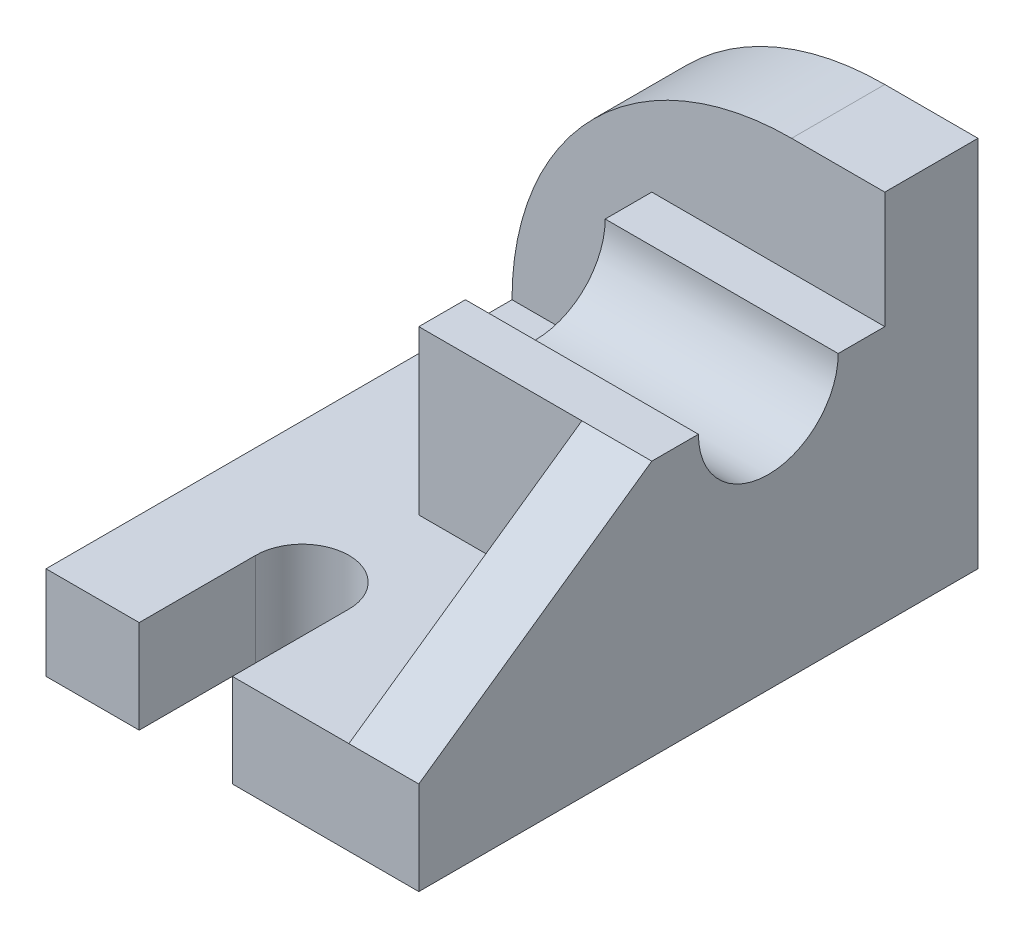
ISO-10303-21;
HEADER;
FILE_DESCRIPTION(('STEP AP214'),'2;1');
FILE_NAME('part.step','',(''),(''),'','','');
FILE_SCHEMA(('AUTOMOTIVE_DESIGN { 1 0 10303 214 1 1 1 1 }'));
ENDSEC;
DATA;
#1=APPLICATION_CONTEXT('core data for automotive mechanical design processes');
#2=APPLICATION_PROTOCOL_DEFINITION('international standard','automotive_design',2000,#1);
#3=PRODUCT_CONTEXT('',#1,'mechanical');
#4=PRODUCT('Part','Part','',(#3));
#5=PRODUCT_RELATED_PRODUCT_CATEGORY('part','',(#4));
#6=PRODUCT_DEFINITION_FORMATION('','',#4);
#7=PRODUCT_DEFINITION_CONTEXT('part definition',#1,'design');
#8=PRODUCT_DEFINITION('design','',#6,#7);
#9=PRODUCT_DEFINITION_SHAPE('','',#8);
#10=(LENGTH_UNIT() NAMED_UNIT(*) SI_UNIT(.MILLI.,.METRE.));
#11=(NAMED_UNIT(*) PLANE_ANGLE_UNIT() SI_UNIT($,.RADIAN.));
#12=(NAMED_UNIT(*) SI_UNIT($,.STERADIAN.) SOLID_ANGLE_UNIT());
#13=UNCERTAINTY_MEASURE_WITH_UNIT(LENGTH_MEASURE(1.E-05),#10,'distance_accuracy_value','');
#14=(GEOMETRIC_REPRESENTATION_CONTEXT(3) GLOBAL_UNCERTAINTY_ASSIGNED_CONTEXT((#13)) GLOBAL_UNIT_ASSIGNED_CONTEXT((#10,
#11,#12)) REPRESENTATION_CONTEXT('',''));
#15=CARTESIAN_POINT('',(0.,0.,0.));
#16=DIRECTION('',(0.,0.,1.));
#17=DIRECTION('',(1.,0.,0.));
#18=AXIS2_PLACEMENT_3D('',#15,#16,#17);
#19=CARTESIAN_POINT('',(-32.,16.,48.));
#20=DIRECTION('',(0.,0.,-1.));
#21=DIRECTION('',(-1.,0.,0.));
#22=AXIS2_PLACEMENT_3D('',#19,#20,#21);
#23=PLANE('',#22);
#24=DIRECTION('',(0.,1.,0.));
#25=VECTOR('',#24,1.);
#26=CARTESIAN_POINT('',(-16.,0.,48.));
#27=LINE('',#26,#25);
#28=CARTESIAN_POINT('',(-16.,0.,48.));
#29=VERTEX_POINT('',#28);
#30=CARTESIAN_POINT('',(-16.,16.,48.));
#31=VERTEX_POINT('',#30);
#32=EDGE_CURVE('E182',#29,#31,#27,.T.);
#33=ORIENTED_EDGE('',*,*,#32,.T.);
#34=DIRECTION('',(1.,0.,0.));
#35=VECTOR('',#34,1.);
#36=CARTESIAN_POINT('',(-32.,16.,48.));
#37=LINE('',#36,#35);
#38=CARTESIAN_POINT('',(-32.,16.,48.));
#39=VERTEX_POINT('',#38);
#40=EDGE_CURVE('E241',#39,#31,#37,.T.);
#41=ORIENTED_EDGE('',*,*,#40,.F.);
#42=DIRECTION('',(0.,-1.,0.));
#43=VECTOR('',#42,1.);
#44=CARTESIAN_POINT('',(-32.,16.,48.));
#45=LINE('',#44,#43);
#46=CARTESIAN_POINT('',(-32.,0.,48.));
#47=VERTEX_POINT('',#46);
#48=EDGE_CURVE('E247',#39,#47,#45,.T.);
#49=ORIENTED_EDGE('',*,*,#48,.T.);
#50=DIRECTION('',(1.,0.,0.));
#51=VECTOR('',#50,1.);
#52=CARTESIAN_POINT('',(-32.,0.,48.));
#53=LINE('',#52,#51);
#54=EDGE_CURVE('E248',#47,#29,#53,.T.);
#55=ORIENTED_EDGE('',*,*,#54,.T.);
#56=EDGE_LOOP('',(#33,#41,#49,#55));
#57=FACE_BOUND('',#56,.T.);
#58=ADVANCED_FACE('F33',(#57),#23,.F.);
#59=CARTESIAN_POINT('',(0.,16.,0.));
#60=DIRECTION('',(0.,-1.,0.));
#61=DIRECTION('',(0.,0.,-1.));
#62=AXIS2_PLACEMENT_3D('',#59,#60,#61);
#63=PLANE('',#62);
#64=CARTESIAN_POINT('',(-8.00000000000002,16.,28.));
#65=DIRECTION('',(0.,1.,0.));
#66=DIRECTION('',(0.,0.,1.));
#67=AXIS2_PLACEMENT_3D('',#64,#65,#66);
#68=CIRCLE('',#67,8.);
#69=CARTESIAN_POINT('',(0.,16.,28.));
#70=VERTEX_POINT('',#69);
#71=CARTESIAN_POINT('',(-16.,16.,28.));
#72=VERTEX_POINT('',#71);
#73=EDGE_CURVE('E173',#70,#72,#68,.T.);
#74=ORIENTED_EDGE('',*,*,#73,.F.);
#75=DIRECTION('',(0.,0.,-1.));
#76=VECTOR('',#75,1.);
#77=CARTESIAN_POINT('',(0.,16.,48.));
#78=LINE('',#77,#76);
#79=CARTESIAN_POINT('',(0.,16.,48.));
#80=VERTEX_POINT('',#79);
#81=EDGE_CURVE('E156',#80,#70,#78,.T.);
#82=ORIENTED_EDGE('',*,*,#81,.F.);
#83=CARTESIAN_POINT('',(19.997847299372,16.,48.));
#84=VERTEX_POINT('',#83);
#85=EDGE_CURVE('E245',#80,#84,#37,.T.);
#86=ORIENTED_EDGE('',*,*,#85,.T.);
#87=DIRECTION('',(0.,0.,1.));
#88=VECTOR('',#87,1.);
#89=CARTESIAN_POINT('',(19.997847299372,16.,8.));
#90=LINE('',#89,#88);
#91=CARTESIAN_POINT('',(19.997847299372,16.,8.));
#92=VERTEX_POINT('',#91);
#93=EDGE_CURVE('E195',#92,#84,#90,.T.);
#94=ORIENTED_EDGE('',*,*,#93,.F.);
#95=DIRECTION('',(1.,0.,0.));
#96=VECTOR('',#95,1.);
#97=CARTESIAN_POINT('',(32.,16.,8.));
#98=LINE('',#97,#96);
#99=CARTESIAN_POINT('',(-8.00000000000001,16.,8.));
#100=VERTEX_POINT('',#99);
#101=EDGE_CURVE('E220',#100,#92,#98,.T.);
#102=ORIENTED_EDGE('',*,*,#101,.F.);
#103=DIRECTION('',(0.,0.,1.));
#104=VECTOR('',#103,1.);
#105=CARTESIAN_POINT('',(-8.00000000000001,16.,-32.));
#106=LINE('',#105,#104);
#107=CARTESIAN_POINT('',(-8.00000000000001,16.,-32.));
#108=VERTEX_POINT('',#107);
#109=EDGE_CURVE('E203',#108,#100,#106,.T.);
#110=ORIENTED_EDGE('',*,*,#109,.F.);
#111=DIRECTION('',(1.,0.,0.));
#112=VECTOR('',#111,1.);
#113=CARTESIAN_POINT('',(-32.,16.,-32.));
#114=LINE('',#113,#112);
#115=CARTESIAN_POINT('',(-32.,16.,-32.));
#116=VERTEX_POINT('',#115);
#117=EDGE_CURVE('E228',#116,#108,#114,.T.);
#118=ORIENTED_EDGE('',*,*,#117,.F.);
#119=DIRECTION('',(0.,0.,1.));
#120=VECTOR('',#119,1.);
#121=CARTESIAN_POINT('',(-32.,16.,-48.));
#122=LINE('',#121,#120);
#123=EDGE_CURVE('E244',#116,#39,#122,.T.);
#124=ORIENTED_EDGE('',*,*,#123,.T.);
#125=ORIENTED_EDGE('',*,*,#40,.T.);
#126=DIRECTION('',(0.,0.,-1.));
#127=VECTOR('',#126,1.);
#128=CARTESIAN_POINT('',(-16.,16.,48.));
#129=LINE('',#128,#127);
#130=EDGE_CURVE('E170',#31,#72,#129,.T.);
#131=ORIENTED_EDGE('',*,*,#130,.T.);
#132=EDGE_LOOP('',(#74,#82,#86,#94,#102,#110,#118,#124,#125,#131));
#133=FACE_BOUND('',#132,.T.);
#134=ADVANCED_FACE('F306',(#133),#63,.F.);
#135=CARTESIAN_POINT('',(32.,44.,8.));
#136=DIRECTION('',(0.,0.,-1.));
#137=DIRECTION('',(-1.,0.,0.));
#138=AXIS2_PLACEMENT_3D('',#135,#136,#137);
#139=PLANE('',#138);
#140=DIRECTION('',(0.,-1.,0.));
#141=VECTOR('',#140,1.);
#142=CARTESIAN_POINT('',(19.997847299372,44.,8.));
#143=LINE('',#142,#141);
#144=CARTESIAN_POINT('',(19.997847299372,44.,8.));
#145=VERTEX_POINT('',#144);
#146=EDGE_CURVE('E198',#145,#92,#143,.T.);
#147=ORIENTED_EDGE('',*,*,#146,.F.);
#148=DIRECTION('',(1.,0.,0.));
#149=VECTOR('',#148,1.);
#150=CARTESIAN_POINT('',(32.,44.,8.));
#151=LINE('',#150,#149);
#152=CARTESIAN_POINT('',(-8.00000000000001,44.,8.));
#153=VERTEX_POINT('',#152);
#154=EDGE_CURVE('E214',#153,#145,#151,.T.);
#155=ORIENTED_EDGE('',*,*,#154,.F.);
#156=DIRECTION('',(0.,-1.,0.));
#157=VECTOR('',#156,1.);
#158=CARTESIAN_POINT('',(-8.00000000000001,44.,8.));
#159=LINE('',#158,#157);
#160=EDGE_CURVE('E217',#153,#100,#159,.T.);
#161=ORIENTED_EDGE('',*,*,#160,.T.);
#162=ORIENTED_EDGE('',*,*,#101,.T.);
#163=EDGE_LOOP('',(#147,#155,#161,#162));
#164=FACE_BOUND('',#163,.T.);
#165=ADVANCED_FACE('F342',(#164),#139,.F.);
#166=CARTESIAN_POINT('',(0.,44.,0.));
#167=DIRECTION('',(0.,-1.,0.));
#168=DIRECTION('',(0.,0.,-1.));
#169=AXIS2_PLACEMENT_3D('',#166,#167,#168);
#170=PLANE('',#169);
#171=ORIENTED_EDGE('',*,*,#154,.T.);
#172=DIRECTION('',(-1.,0.,0.));
#173=VECTOR('',#172,1.);
#174=CARTESIAN_POINT('',(49.997847299372,44.,8.));
#175=LINE('',#174,#173);
#176=CARTESIAN_POINT('',(32.,44.,8.));
#177=VERTEX_POINT('',#176);
#178=EDGE_CURVE('E188',#177,#145,#175,.T.);
#179=ORIENTED_EDGE('',*,*,#178,.F.);
#180=DIRECTION('',(0.,0.,-1.));
#181=VECTOR('',#180,1.);
#182=CARTESIAN_POINT('',(32.,44.,-32.));
#183=LINE('',#182,#181);
#184=CARTESIAN_POINT('',(32.,44.,0.));
#185=VERTEX_POINT('',#184);
#186=EDGE_CURVE('E204',#177,#185,#183,.T.);
#187=ORIENTED_EDGE('',*,*,#186,.T.);
#188=DIRECTION('',(-1.,0.,0.));
#189=VECTOR('',#188,1.);
#190=CARTESIAN_POINT('',(55.,44.,0.));
#191=LINE('',#190,#189);
#192=CARTESIAN_POINT('',(-8.00000000000001,44.,0.));
#193=VERTEX_POINT('',#192);
#194=EDGE_CURVE('E11',#185,#193,#191,.T.);
#195=ORIENTED_EDGE('',*,*,#194,.T.);
#196=DIRECTION('',(0.,0.,1.));
#197=VECTOR('',#196,1.);
#198=CARTESIAN_POINT('',(-8.00000000000001,44.,-32.));
#199=LINE('',#198,#197);
#200=EDGE_CURVE('E210',#193,#153,#199,.T.);
#201=ORIENTED_EDGE('',*,*,#200,.T.);
#202=EDGE_LOOP('',(#171,#179,#187,#195,#201));
#203=FACE_BOUND('',#202,.T.);
#204=ADVANCED_FACE('F297',(#203),#170,.F.);
#205=CARTESIAN_POINT('',(-32.,64.,-32.));
#206=DIRECTION('',(0.,0.,-1.));
#207=DIRECTION('',(-1.,0.,0.));
#208=AXIS2_PLACEMENT_3D('',#205,#206,#207);
#209=PLANE('',#208);
#210=DIRECTION('',(0.,-1.,0.));
#211=VECTOR('',#210,1.);
#212=CARTESIAN_POINT('',(-8.00000000000001,44.,-32.));
#213=LINE('',#212,#211);
#214=CARTESIAN_POINT('',(-8.00000000000001,44.,-32.));
#215=VERTEX_POINT('',#214);
#216=EDGE_CURVE('E225',#215,#108,#213,.T.);
#217=ORIENTED_EDGE('',*,*,#216,.F.);
#218=DIRECTION('',(-1.,0.,0.));
#219=VECTOR('',#218,1.);
#220=CARTESIAN_POINT('',(32.,44.,-32.));
#221=LINE('',#220,#219);
#222=CARTESIAN_POINT('',(32.,44.,-32.));
#223=VERTEX_POINT('',#222);
#224=EDGE_CURVE('E206',#223,#215,#221,.T.);
#225=ORIENTED_EDGE('',*,*,#224,.F.);
#226=DIRECTION('',(0.,-1.,0.));
#227=VECTOR('',#226,1.);
#228=CARTESIAN_POINT('',(32.,64.,-32.));
#229=LINE('',#228,#227);
#230=CARTESIAN_POINT('',(32.,64.,-32.));
#231=VERTEX_POINT('',#230);
#232=EDGE_CURVE('E236',#231,#223,#229,.T.);
#233=ORIENTED_EDGE('',*,*,#232,.F.);
#234=DIRECTION('',(1.,0.,0.));
#235=VECTOR('',#234,1.);
#236=CARTESIAN_POINT('',(-32.,64.,-32.));
#237=LINE('',#236,#235);
#238=CARTESIAN_POINT('',(16.,64.,-32.));
#239=VERTEX_POINT('',#238);
#240=EDGE_CURVE('E229',#239,#231,#237,.T.);
#241=ORIENTED_EDGE('',*,*,#240,.F.);
#242=CARTESIAN_POINT('',(16.,16.,-32.));
#243=DIRECTION('',(0.,0.,-1.));
#244=DIRECTION('',(-1.,0.,0.));
#245=AXIS2_PLACEMENT_3D('',#242,#243,#244);
#246=CIRCLE('',#245,48.);
#247=EDGE_CURVE('E270',#239,#116,#246,.F.);
#248=ORIENTED_EDGE('',*,*,#247,.T.);
#249=ORIENTED_EDGE('',*,*,#117,.T.);
#250=EDGE_LOOP('',(#217,#225,#233,#241,#248,#249));
#251=FACE_BOUND('',#250,.T.);
#252=ADVANCED_FACE('F290',(#251),#209,.F.);
#253=ORIENTED_EDGE('',*,*,#85,.F.);
#254=DIRECTION('',(0.,1.,0.));
#255=VECTOR('',#254,1.);
#256=CARTESIAN_POINT('',(0.,0.,48.));
#257=LINE('',#256,#255);
#258=CARTESIAN_POINT('',(0.,0.,48.));
#259=VERTEX_POINT('',#258);
#260=EDGE_CURVE('E179',#259,#80,#257,.T.);
#261=ORIENTED_EDGE('',*,*,#260,.F.);
#262=CARTESIAN_POINT('',(32.,0.,48.));
#263=VERTEX_POINT('',#262);
#264=EDGE_CURVE('E169',#259,#263,#53,.T.);
#265=ORIENTED_EDGE('',*,*,#264,.T.);
#266=DIRECTION('',(0.,-1.,0.));
#267=VECTOR('',#266,1.);
#268=CARTESIAN_POINT('',(32.,16.,48.));
#269=LINE('',#268,#267);
#270=CARTESIAN_POINT('',(32.,16.,48.));
#271=VERTEX_POINT('',#270);
#272=EDGE_CURVE('E264',#271,#263,#269,.T.);
#273=ORIENTED_EDGE('',*,*,#272,.F.);
#274=DIRECTION('',(-1.,0.,0.));
#275=VECTOR('',#274,1.);
#276=CARTESIAN_POINT('',(49.997847299372,16.,48.));
#277=LINE('',#276,#275);
#278=EDGE_CURVE('E189',#271,#84,#277,.T.);
#279=ORIENTED_EDGE('',*,*,#278,.T.);
#280=EDGE_LOOP('',(#253,#261,#265,#273,#279));
#281=FACE_BOUND('',#280,.T.);
#282=ADVANCED_FACE('F304',(#281),#23,.F.);
#283=CARTESIAN_POINT('',(32.,16.,-48.));
#284=DIRECTION('',(1.,0.,0.));
#285=DIRECTION('',(0.,0.,-1.));
#286=AXIS2_PLACEMENT_3D('',#283,#284,#285);
#287=PLANE('',#286);
#288=DIRECTION('',(0.,0.573462344363328,-0.819231920519041));
#289=VECTOR('',#288,1.);
#290=CARTESIAN_POINT('',(32.,61.1006711409396,-16.4295302013423));
#291=LINE('',#290,#289);
#292=EDGE_CURVE('E192',#271,#177,#291,.T.);
#293=ORIENTED_EDGE('',*,*,#292,.F.);
#294=ORIENTED_EDGE('',*,*,#272,.T.);
#295=DIRECTION('',(0.,0.,1.));
#296=VECTOR('',#295,1.);
#297=CARTESIAN_POINT('',(32.,0.,-48.));
#298=LINE('',#297,#296);
#299=CARTESIAN_POINT('',(32.,0.,-48.));
#300=VERTEX_POINT('',#299);
#301=EDGE_CURVE('E251',#300,#263,#298,.T.);
#302=ORIENTED_EDGE('',*,*,#301,.F.);
#303=DIRECTION('',(0.,-1.,0.));
#304=VECTOR('',#303,1.);
#305=CARTESIAN_POINT('',(32.,16.,-48.));
#306=LINE('',#305,#304);
#307=CARTESIAN_POINT('',(32.,64.,-48.));
#308=VERTEX_POINT('',#307);
#309=EDGE_CURVE('E262',#308,#300,#306,.T.);
#310=ORIENTED_EDGE('',*,*,#309,.F.);
#311=DIRECTION('',(0.,0.,1.));
#312=VECTOR('',#311,1.);
#313=CARTESIAN_POINT('',(32.,64.,-48.));
#314=LINE('',#313,#312);
#315=EDGE_CURVE('E231',#308,#231,#314,.T.);
#316=ORIENTED_EDGE('',*,*,#315,.T.);
#317=ORIENTED_EDGE('',*,*,#232,.T.);
#318=CARTESIAN_POINT('',(32.,44.,-24.));
#319=VERTEX_POINT('',#318);
#320=EDGE_CURVE('E207',#319,#223,#183,.T.);
#321=ORIENTED_EDGE('',*,*,#320,.F.);
#322=CARTESIAN_POINT('',(32.,44.,-12.));
#323=DIRECTION('',(1.,0.,0.));
#324=DIRECTION('',(0.,0.,-1.));
#325=AXIS2_PLACEMENT_3D('',#322,#323,#324);
#326=CIRCLE('',#325,12.);
#327=EDGE_CURVE('E56',#185,#319,#326,.T.);
#328=ORIENTED_EDGE('',*,*,#327,.F.);
#329=ORIENTED_EDGE('',*,*,#186,.F.);
#330=EDGE_LOOP('',(#293,#294,#302,#310,#316,#317,#321,#328,#329));
#331=FACE_BOUND('',#330,.T.);
#332=ADVANCED_FACE('F283',(#331),#287,.T.);
#333=CARTESIAN_POINT('',(-32.,16.,-48.));
#334=DIRECTION('',(0.,0.,-1.));
#335=DIRECTION('',(-1.,0.,0.));
#336=AXIS2_PLACEMENT_3D('',#333,#334,#335);
#337=PLANE('',#336);
#338=DIRECTION('',(0.,-1.,0.));
#339=VECTOR('',#338,1.);
#340=CARTESIAN_POINT('',(-32.,16.,-48.));
#341=LINE('',#340,#339);
#342=CARTESIAN_POINT('',(-32.,16.,-48.));
#343=VERTEX_POINT('',#342);
#344=CARTESIAN_POINT('',(-32.,0.,-48.));
#345=VERTEX_POINT('',#344);
#346=EDGE_CURVE('E260',#343,#345,#341,.T.);
#347=ORIENTED_EDGE('',*,*,#346,.F.);
#348=CARTESIAN_POINT('',(16.,16.,-48.));
#349=DIRECTION('',(0.,0.,-1.));
#350=DIRECTION('',(-1.,0.,0.));
#351=AXIS2_PLACEMENT_3D('',#348,#349,#350);
#352=CIRCLE('',#351,48.);
#353=CARTESIAN_POINT('',(16.,64.,-48.));
#354=VERTEX_POINT('',#353);
#355=EDGE_CURVE('E274',#343,#354,#352,.T.);
#356=ORIENTED_EDGE('',*,*,#355,.T.);
#357=DIRECTION('',(1.,0.,0.));
#358=VECTOR('',#357,1.);
#359=CARTESIAN_POINT('',(-32.,64.,-48.));
#360=LINE('',#359,#358);
#361=EDGE_CURVE('E234',#354,#308,#360,.T.);
#362=ORIENTED_EDGE('',*,*,#361,.T.);
#363=ORIENTED_EDGE('',*,*,#309,.T.);
#364=DIRECTION('',(1.,0.,0.));
#365=VECTOR('',#364,1.);
#366=CARTESIAN_POINT('',(-32.,0.,-48.));
#367=LINE('',#366,#365);
#368=EDGE_CURVE('E253',#345,#300,#367,.T.);
#369=ORIENTED_EDGE('',*,*,#368,.F.);
#370=EDGE_LOOP('',(#347,#356,#362,#363,#369));
#371=FACE_BOUND('',#370,.T.);
#372=ADVANCED_FACE('F319',(#371),#337,.T.);
#373=CARTESIAN_POINT('',(-32.,16.,-48.));
#374=DIRECTION('',(1.,0.,0.));
#375=DIRECTION('',(0.,0.,-1.));
#376=AXIS2_PLACEMENT_3D('',#373,#374,#375);
#377=PLANE('',#376);
#378=ORIENTED_EDGE('',*,*,#123,.F.);
#379=DIRECTION('',(0.,0.,1.));
#380=VECTOR('',#379,1.);
#381=CARTESIAN_POINT('',(-32.,16.,-48.));
#382=LINE('',#381,#380);
#383=EDGE_CURVE('E272',#116,#343,#382,.F.);
#384=ORIENTED_EDGE('',*,*,#383,.T.);
#385=ORIENTED_EDGE('',*,*,#346,.T.);
#386=DIRECTION('',(0.,0.,1.));
#387=VECTOR('',#386,1.);
#388=CARTESIAN_POINT('',(-32.,0.,-48.));
#389=LINE('',#388,#387);
#390=EDGE_CURVE('E256',#345,#47,#389,.T.);
#391=ORIENTED_EDGE('',*,*,#390,.T.);
#392=ORIENTED_EDGE('',*,*,#48,.F.);
#393=EDGE_LOOP('',(#378,#384,#385,#391,#392));
#394=FACE_BOUND('',#393,.T.);
#395=ADVANCED_FACE('F329',(#394),#377,.F.);
#396=CARTESIAN_POINT('',(0.,0.,0.));
#397=DIRECTION('',(0.,-1.,0.));
#398=DIRECTION('',(0.,0.,-1.));
#399=AXIS2_PLACEMENT_3D('',#396,#397,#398);
#400=PLANE('',#399);
#401=DIRECTION('',(0.,0.,-1.));
#402=VECTOR('',#401,1.);
#403=CARTESIAN_POINT('',(0.,0.,48.));
#404=LINE('',#403,#402);
#405=CARTESIAN_POINT('',(0.,0.,28.));
#406=VERTEX_POINT('',#405);
#407=EDGE_CURVE('E153',#259,#406,#404,.T.);
#408=ORIENTED_EDGE('',*,*,#407,.T.);
#409=CARTESIAN_POINT('',(-8.00000000000002,0.,28.));
#410=DIRECTION('',(0.,1.,0.));
#411=DIRECTION('',(0.,0.,1.));
#412=AXIS2_PLACEMENT_3D('',#409,#410,#411);
#413=CIRCLE('',#412,8.);
#414=CARTESIAN_POINT('',(-16.,0.,28.));
#415=VERTEX_POINT('',#414);
#416=EDGE_CURVE('E161',#406,#415,#413,.T.);
#417=ORIENTED_EDGE('',*,*,#416,.T.);
#418=DIRECTION('',(0.,0.,-1.));
#419=VECTOR('',#418,1.);
#420=CARTESIAN_POINT('',(-16.,0.,48.));
#421=LINE('',#420,#419);
#422=EDGE_CURVE('E158',#29,#415,#421,.T.);
#423=ORIENTED_EDGE('',*,*,#422,.F.);
#424=ORIENTED_EDGE('',*,*,#54,.F.);
#425=ORIENTED_EDGE('',*,*,#390,.F.);
#426=ORIENTED_EDGE('',*,*,#368,.T.);
#427=ORIENTED_EDGE('',*,*,#301,.T.);
#428=ORIENTED_EDGE('',*,*,#264,.F.);
#429=EDGE_LOOP('',(#408,#417,#423,#424,#425,#426,#427,#428));
#430=FACE_BOUND('',#429,.T.);
#431=ADVANCED_FACE('F167',(#430),#400,.T.);
#432=CARTESIAN_POINT('',(0.,64.,0.));
#433=DIRECTION('',(0.,-1.,0.));
#434=DIRECTION('',(0.,0.,-1.));
#435=AXIS2_PLACEMENT_3D('',#432,#433,#434);
#436=PLANE('',#435);
#437=ORIENTED_EDGE('',*,*,#361,.F.);
#438=DIRECTION('',(0.,0.,1.));
#439=VECTOR('',#438,1.);
#440=CARTESIAN_POINT('',(16.,64.,0.));
#441=LINE('',#440,#439);
#442=EDGE_CURVE('E267',#354,#239,#441,.T.);
#443=ORIENTED_EDGE('',*,*,#442,.T.);
#444=ORIENTED_EDGE('',*,*,#240,.T.);
#445=ORIENTED_EDGE('',*,*,#315,.F.);
#446=EDGE_LOOP('',(#437,#443,#444,#445));
#447=FACE_BOUND('',#446,.T.);
#448=ADVANCED_FACE('F323',(#447),#436,.F.);
#449=CARTESIAN_POINT('',(16.,16.,0.));
#450=DIRECTION('',(0.,0.,1.));
#451=DIRECTION('',(1.,0.,0.));
#452=AXIS2_PLACEMENT_3D('',#449,#450,#451);
#453=CYLINDRICAL_SURFACE('',#452,48.);
#454=ORIENTED_EDGE('',*,*,#355,.F.);
#455=ORIENTED_EDGE('',*,*,#383,.F.);
#456=ORIENTED_EDGE('',*,*,#247,.F.);
#457=ORIENTED_EDGE('',*,*,#442,.F.);
#458=EDGE_LOOP('',(#454,#455,#456,#457));
#459=FACE_BOUND('',#458,.T.);
#460=ADVANCED_FACE('F35',(#459),#453,.T.);
#461=CARTESIAN_POINT('',(-8.00000000000001,44.,-32.));
#462=DIRECTION('',(1.,0.,0.));
#463=DIRECTION('',(0.,0.,-1.));
#464=AXIS2_PLACEMENT_3D('',#461,#462,#463);
#465=PLANE('',#464);
#466=ORIENTED_EDGE('',*,*,#200,.F.);
#467=CARTESIAN_POINT('',(-8.00000000000001,44.,-12.));
#468=DIRECTION('',(-1.,0.,0.));
#469=DIRECTION('',(0.,0.,1.));
#470=AXIS2_PLACEMENT_3D('',#467,#468,#469);
#471=CIRCLE('',#470,12.);
#472=CARTESIAN_POINT('',(-8.00000000000001,44.,-24.));
#473=VERTEX_POINT('',#472);
#474=EDGE_CURVE('E200',#473,#193,#471,.T.);
#475=ORIENTED_EDGE('',*,*,#474,.F.);
#476=EDGE_CURVE('E211',#215,#473,#199,.T.);
#477=ORIENTED_EDGE('',*,*,#476,.F.);
#478=ORIENTED_EDGE('',*,*,#216,.T.);
#479=ORIENTED_EDGE('',*,*,#109,.T.);
#480=ORIENTED_EDGE('',*,*,#160,.F.);
#481=EDGE_LOOP('',(#466,#475,#477,#478,#479,#480));
#482=FACE_BOUND('',#481,.T.);
#483=ADVANCED_FACE('F293',(#482),#465,.F.);
#484=ORIENTED_EDGE('',*,*,#476,.T.);
#485=DIRECTION('',(-1.,0.,0.));
#486=VECTOR('',#485,1.);
#487=CARTESIAN_POINT('',(55.,44.,-24.));
#488=LINE('',#487,#486);
#489=EDGE_CURVE('E41',#473,#319,#488,.F.);
#490=ORIENTED_EDGE('',*,*,#489,.T.);
#491=ORIENTED_EDGE('',*,*,#320,.T.);
#492=ORIENTED_EDGE('',*,*,#224,.T.);
#493=EDGE_LOOP('',(#484,#490,#491,#492));
#494=FACE_BOUND('',#493,.T.);
#495=ADVANCED_FACE('F277',(#494),#170,.F.);
#496=CARTESIAN_POINT('',(55.,44.,-12.));
#497=DIRECTION('',(-1.,0.,0.));
#498=DIRECTION('',(0.,0.,1.));
#499=AXIS2_PLACEMENT_3D('',#496,#497,#498);
#500=CYLINDRICAL_SURFACE('',#499,12.);
#501=ORIENTED_EDGE('',*,*,#327,.T.);
#502=ORIENTED_EDGE('',*,*,#489,.F.);
#503=ORIENTED_EDGE('',*,*,#474,.T.);
#504=ORIENTED_EDGE('',*,*,#194,.F.);
#505=EDGE_LOOP('',(#501,#502,#503,#504));
#506=FACE_BOUND('',#505,.T.);
#507=ADVANCED_FACE('F295',(#506),#500,.F.);
#508=CARTESIAN_POINT('',(19.997847299372,44.,8.));
#509=DIRECTION('',(1.,0.,0.));
#510=DIRECTION('',(0.,0.,-1.));
#511=AXIS2_PLACEMENT_3D('',#508,#509,#510);
#512=PLANE('',#511);
#513=ORIENTED_EDGE('',*,*,#93,.T.);
#514=DIRECTION('',(0.,-0.573462344363328,0.819231920519041));
#515=VECTOR('',#514,1.);
#516=CARTESIAN_POINT('',(19.997847299372,44.,8.));
#517=LINE('',#516,#515);
#518=EDGE_CURVE('E181',#145,#84,#517,.T.);
#519=ORIENTED_EDGE('',*,*,#518,.F.);
#520=ORIENTED_EDGE('',*,*,#146,.T.);
#521=EDGE_LOOP('',(#513,#519,#520));
#522=FACE_BOUND('',#521,.T.);
#523=ADVANCED_FACE('F366',(#522),#512,.F.);
#524=CARTESIAN_POINT('',(49.997847299372,44.,8.));
#525=DIRECTION('',(0.,-0.819231920519041,-0.573462344363328));
#526=DIRECTION('',(0.,0.573462344363328,-0.819231920519041));
#527=AXIS2_PLACEMENT_3D('',#524,#525,#526);
#528=PLANE('',#527);
#529=ORIENTED_EDGE('',*,*,#292,.T.);
#530=ORIENTED_EDGE('',*,*,#178,.T.);
#531=ORIENTED_EDGE('',*,*,#518,.T.);
#532=ORIENTED_EDGE('',*,*,#278,.F.);
#533=EDGE_LOOP('',(#529,#530,#531,#532));
#534=FACE_BOUND('',#533,.T.);
#535=ADVANCED_FACE('F369',(#534),#528,.F.);
#536=CARTESIAN_POINT('',(0.,0.,48.));
#537=DIRECTION('',(1.,0.,0.));
#538=DIRECTION('',(0.,0.,-1.));
#539=AXIS2_PLACEMENT_3D('',#536,#537,#538);
#540=PLANE('',#539);
#541=ORIENTED_EDGE('',*,*,#81,.T.);
#542=DIRECTION('',(0.,1.,0.));
#543=VECTOR('',#542,1.);
#544=CARTESIAN_POINT('',(0.,0.,28.));
#545=LINE('',#544,#543);
#546=EDGE_CURVE('E150',#406,#70,#545,.T.);
#547=ORIENTED_EDGE('',*,*,#546,.F.);
#548=ORIENTED_EDGE('',*,*,#407,.F.);
#549=ORIENTED_EDGE('',*,*,#260,.T.);
#550=EDGE_LOOP('',(#541,#547,#548,#549));
#551=FACE_BOUND('',#550,.T.);
#552=ADVANCED_FACE('F151',(#551),#540,.F.);
#553=CARTESIAN_POINT('',(-16.,0.,48.));
#554=DIRECTION('',(1.,0.,0.));
#555=DIRECTION('',(0.,0.,-1.));
#556=AXIS2_PLACEMENT_3D('',#553,#554,#555);
#557=PLANE('',#556);
#558=ORIENTED_EDGE('',*,*,#130,.F.);
#559=ORIENTED_EDGE('',*,*,#32,.F.);
#560=ORIENTED_EDGE('',*,*,#422,.T.);
#561=DIRECTION('',(0.,1.,0.));
#562=VECTOR('',#561,1.);
#563=CARTESIAN_POINT('',(-16.,0.,28.));
#564=LINE('',#563,#562);
#565=EDGE_CURVE('E48',#415,#72,#564,.T.);
#566=ORIENTED_EDGE('',*,*,#565,.T.);
#567=EDGE_LOOP('',(#558,#559,#560,#566));
#568=FACE_BOUND('',#567,.T.);
#569=ADVANCED_FACE('F310',(#568),#557,.T.);
#570=CARTESIAN_POINT('',(-8.00000000000002,0.,28.));
#571=DIRECTION('',(0.,1.,0.));
#572=DIRECTION('',(0.,0.,1.));
#573=AXIS2_PLACEMENT_3D('',#570,#571,#572);
#574=CYLINDRICAL_SURFACE('',#573,8.);
#575=ORIENTED_EDGE('',*,*,#73,.T.);
#576=ORIENTED_EDGE('',*,*,#565,.F.);
#577=ORIENTED_EDGE('',*,*,#416,.F.);
#578=ORIENTED_EDGE('',*,*,#546,.T.);
#579=EDGE_LOOP('',(#575,#576,#577,#578));
#580=FACE_BOUND('',#579,.T.);
#581=ADVANCED_FACE('F162',(#580),#574,.F.);
#582=CLOSED_SHELL('',(#58,#134,#165,#204,#252,#282,#332,#372,#395,#431,#448,#460,#483,#495,#507,
#523,#535,#552,#569,#581));
#583=MANIFOLD_SOLID_BREP('B2',#582);
#584=ADVANCED_BREP_SHAPE_REPRESENTATION('',(#18,#583),#14);
#585=SHAPE_DEFINITION_REPRESENTATION(#9,#584);
ENDSEC;
END-ISO-10303-21;
